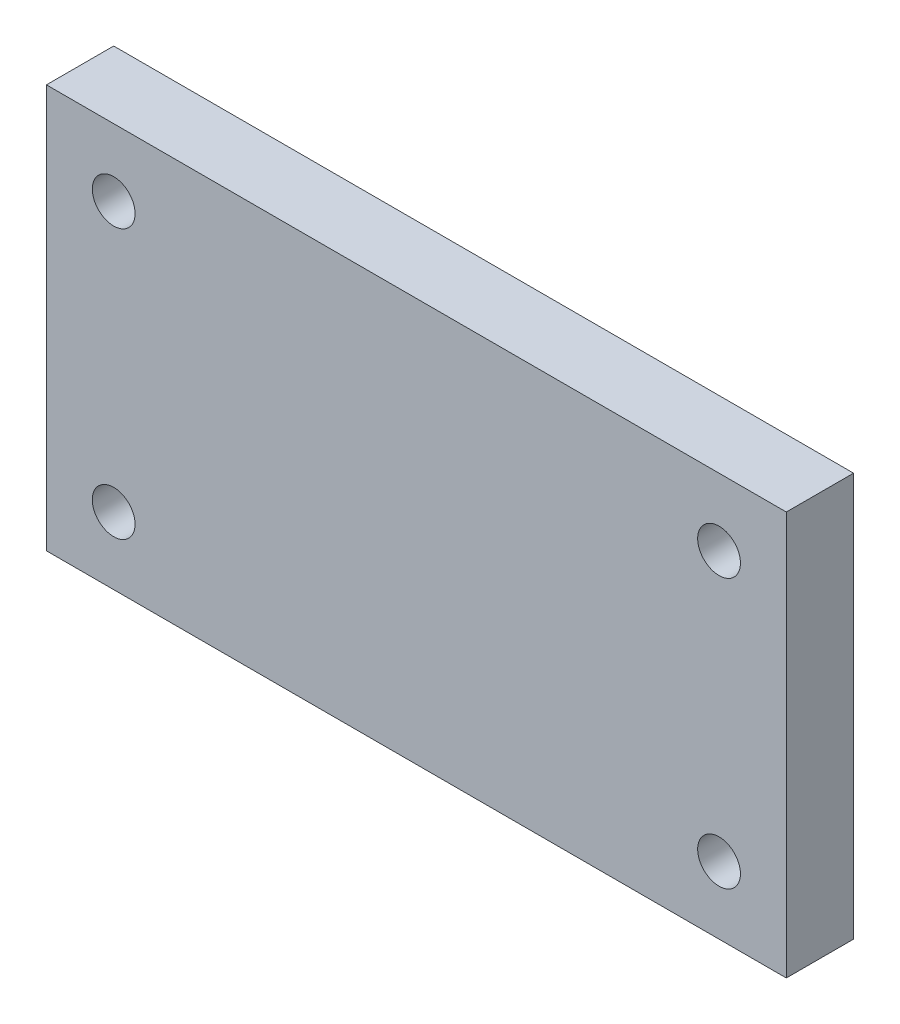
ISO-10303-21;
HEADER;
FILE_DESCRIPTION(('STEP AP214'),'2;1');
FILE_NAME('part.step','',(''),(''),'','','');
FILE_SCHEMA(('AUTOMOTIVE_DESIGN { 1 0 10303 214 1 1 1 1 }'));
ENDSEC;
DATA;
#1=APPLICATION_CONTEXT('core data for automotive mechanical design processes');
#2=APPLICATION_PROTOCOL_DEFINITION('international standard','automotive_design',2000,#1);
#3=PRODUCT_CONTEXT('',#1,'mechanical');
#4=PRODUCT('Part','Part','',(#3));
#5=PRODUCT_RELATED_PRODUCT_CATEGORY('part','',(#4));
#6=PRODUCT_DEFINITION_FORMATION('','',#4);
#7=PRODUCT_DEFINITION_CONTEXT('part definition',#1,'design');
#8=PRODUCT_DEFINITION('design','',#6,#7);
#9=PRODUCT_DEFINITION_SHAPE('','',#8);
#10=(LENGTH_UNIT() NAMED_UNIT(*) SI_UNIT(.MILLI.,.METRE.));
#11=(NAMED_UNIT(*) PLANE_ANGLE_UNIT() SI_UNIT($,.RADIAN.));
#12=(NAMED_UNIT(*) SI_UNIT($,.STERADIAN.) SOLID_ANGLE_UNIT());
#13=UNCERTAINTY_MEASURE_WITH_UNIT(LENGTH_MEASURE(1.E-05),#10,'distance_accuracy_value','');
#14=(GEOMETRIC_REPRESENTATION_CONTEXT(3) GLOBAL_UNCERTAINTY_ASSIGNED_CONTEXT((#13)) GLOBAL_UNIT_ASSIGNED_CONTEXT((#10,
#11,#12)) REPRESENTATION_CONTEXT('',''));
#15=CARTESIAN_POINT('',(0.,0.,0.));
#16=DIRECTION('',(0.,0.,1.));
#17=DIRECTION('',(1.,0.,0.));
#18=AXIS2_PLACEMENT_3D('',#15,#16,#17);
#19=CARTESIAN_POINT('',(23.0502000000002,0.,6.35));
#20=DIRECTION('',(-1.,0.,0.));
#21=DIRECTION('',(0.,0.,1.));
#22=AXIS2_PLACEMENT_3D('',#19,#20,#21);
#23=PLANE('',#22);
#24=DIRECTION('',(0.,1.,0.));
#25=VECTOR('',#24,1.);
#26=CARTESIAN_POINT('',(23.0502000000002,0.,0.));
#27=LINE('',#26,#25);
#28=CARTESIAN_POINT('',(23.0502000000002,-19.05,0.));
#29=VERTEX_POINT('',#28);
#30=CARTESIAN_POINT('',(23.0502000000002,19.05,0.));
#31=VERTEX_POINT('',#30);
#32=EDGE_CURVE('E116',#29,#31,#27,.T.);
#33=ORIENTED_EDGE('',*,*,#32,.F.);
#34=DIRECTION('',(0.,0.,-1.));
#35=VECTOR('',#34,1.);
#36=CARTESIAN_POINT('',(23.0502000000002,-19.05,6.35));
#37=LINE('',#36,#35);
#38=CARTESIAN_POINT('',(23.0502000000002,-19.05,6.35));
#39=VERTEX_POINT('',#38);
#40=EDGE_CURVE('E11',#39,#29,#37,.T.);
#41=ORIENTED_EDGE('',*,*,#40,.F.);
#42=DIRECTION('',(0.,1.,0.));
#43=VECTOR('',#42,1.);
#44=CARTESIAN_POINT('',(23.0502000000002,0.,6.35));
#45=LINE('',#44,#43);
#46=CARTESIAN_POINT('',(23.0502000000002,19.05,6.35));
#47=VERTEX_POINT('',#46);
#48=EDGE_CURVE('E97',#39,#47,#45,.T.);
#49=ORIENTED_EDGE('',*,*,#48,.T.);
#50=DIRECTION('',(0.,0.,-1.));
#51=VECTOR('',#50,1.);
#52=CARTESIAN_POINT('',(23.0502000000002,19.05,6.35));
#53=LINE('',#52,#51);
#54=EDGE_CURVE('E76',#47,#31,#53,.T.);
#55=ORIENTED_EDGE('',*,*,#54,.T.);
#56=EDGE_LOOP('',(#33,#41,#49,#55));
#57=FACE_BOUND('',#56,.T.);
#58=ADVANCED_FACE('F36',(#57),#23,.T.);
#59=CARTESIAN_POINT('',(0.,-19.05,6.35));
#60=DIRECTION('',(0.,-1.,0.));
#61=DIRECTION('',(0.,0.,-1.));
#62=AXIS2_PLACEMENT_3D('',#59,#60,#61);
#63=PLANE('',#62);
#64=DIRECTION('',(-1.,0.,0.));
#65=VECTOR('',#64,1.);
#66=CARTESIAN_POINT('',(0.,-19.05,0.));
#67=LINE('',#66,#65);
#68=CARTESIAN_POINT('',(92.9002000000002,-19.05,0.));
#69=VERTEX_POINT('',#68);
#70=EDGE_CURVE('E88',#69,#29,#67,.T.);
#71=ORIENTED_EDGE('',*,*,#70,.F.);
#72=DIRECTION('',(0.,0.,-1.));
#73=VECTOR('',#72,1.);
#74=CARTESIAN_POINT('',(92.9002000000002,-19.05,6.35));
#75=LINE('',#74,#73);
#76=CARTESIAN_POINT('',(92.9002000000002,-19.05,6.35));
#77=VERTEX_POINT('',#76);
#78=EDGE_CURVE('E45',#77,#69,#75,.T.);
#79=ORIENTED_EDGE('',*,*,#78,.F.);
#80=DIRECTION('',(-1.,0.,0.));
#81=VECTOR('',#80,1.);
#82=CARTESIAN_POINT('',(0.,-19.05,6.35));
#83=LINE('',#82,#81);
#84=EDGE_CURVE('E86',#77,#39,#83,.T.);
#85=ORIENTED_EDGE('',*,*,#84,.T.);
#86=ORIENTED_EDGE('',*,*,#40,.T.);
#87=EDGE_LOOP('',(#71,#79,#85,#86));
#88=FACE_BOUND('',#87,.T.);
#89=ADVANCED_FACE('F84',(#88),#63,.T.);
#90=CARTESIAN_POINT('',(92.9002000000002,0.,6.35));
#91=DIRECTION('',(-1.,0.,0.));
#92=DIRECTION('',(0.,-1.,0.));
#93=AXIS2_PLACEMENT_3D('',#90,#91,#92);
#94=PLANE('',#93);
#95=DIRECTION('',(0.,1.,0.));
#96=VECTOR('',#95,1.);
#97=CARTESIAN_POINT('',(92.9002000000002,0.,0.));
#98=LINE('',#97,#96);
#99=CARTESIAN_POINT('',(92.9002000000002,19.05,0.));
#100=VERTEX_POINT('',#99);
#101=EDGE_CURVE('E119',#69,#100,#98,.T.);
#102=ORIENTED_EDGE('',*,*,#101,.T.);
#103=DIRECTION('',(0.,0.,-1.));
#104=VECTOR('',#103,1.);
#105=CARTESIAN_POINT('',(92.9002000000002,19.05,6.35));
#106=LINE('',#105,#104);
#107=CARTESIAN_POINT('',(92.9002000000002,19.05,6.35));
#108=VERTEX_POINT('',#107);
#109=EDGE_CURVE('E91',#108,#100,#106,.T.);
#110=ORIENTED_EDGE('',*,*,#109,.F.);
#111=DIRECTION('',(0.,1.,0.));
#112=VECTOR('',#111,1.);
#113=CARTESIAN_POINT('',(92.9002000000002,0.,6.35));
#114=LINE('',#113,#112);
#115=EDGE_CURVE('E93',#77,#108,#114,.T.);
#116=ORIENTED_EDGE('',*,*,#115,.F.);
#117=ORIENTED_EDGE('',*,*,#78,.T.);
#118=EDGE_LOOP('',(#102,#110,#116,#117));
#119=FACE_BOUND('',#118,.T.);
#120=ADVANCED_FACE('F94',(#119),#94,.F.);
#121=CARTESIAN_POINT('',(86.5502000000002,12.7,6.35));
#122=DIRECTION('',(0.,0.,-1.));
#123=DIRECTION('',(-1.,0.,0.));
#124=AXIS2_PLACEMENT_3D('',#121,#122,#123);
#125=CYLINDRICAL_SURFACE('',#124,2.01929999999986);
#126=CARTESIAN_POINT('',(86.5502000000002,12.7,6.35));
#127=DIRECTION('',(0.,0.,1.));
#128=DIRECTION('',(1.,0.,0.));
#129=AXIS2_PLACEMENT_3D('',#126,#127,#128);
#130=CIRCLE('',#129,2.01929999999986);
#131=CARTESIAN_POINT('',(88.5695000000001,12.7,6.35));
#132=VERTEX_POINT('',#131);
#133=EDGE_CURVE('E99',#132,#132,#130,.T.);
#134=ORIENTED_EDGE('',*,*,#133,.T.);
#135=EDGE_LOOP('',(#134));
#136=FACE_BOUND('',#135,.T.);
#137=CARTESIAN_POINT('',(86.5502000000002,12.7,0.));
#138=DIRECTION('',(0.,0.,1.));
#139=DIRECTION('',(1.,0.,0.));
#140=AXIS2_PLACEMENT_3D('',#137,#138,#139);
#141=CIRCLE('',#140,2.01929999999986);
#142=CARTESIAN_POINT('',(88.5695000000001,12.7,0.));
#143=VERTEX_POINT('',#142);
#144=EDGE_CURVE('E113',#143,#143,#141,.T.);
#145=ORIENTED_EDGE('',*,*,#144,.F.);
#146=EDGE_LOOP('',(#145));
#147=FACE_BOUND('',#146,.T.);
#148=ADVANCED_FACE('F135',(#136,#147),#125,.F.);
#149=CARTESIAN_POINT('',(29.4002000000002,12.7,6.35));
#150=DIRECTION('',(0.,0.,-1.));
#151=DIRECTION('',(-1.,0.,0.));
#152=AXIS2_PLACEMENT_3D('',#149,#150,#151);
#153=CYLINDRICAL_SURFACE('',#152,2.01930000000001);
#154=CARTESIAN_POINT('',(29.4002000000002,12.7,6.35));
#155=DIRECTION('',(0.,0.,1.));
#156=DIRECTION('',(1.,0.,0.));
#157=AXIS2_PLACEMENT_3D('',#154,#155,#156);
#158=CIRCLE('',#157,2.01930000000001);
#159=CARTESIAN_POINT('',(31.4195000000003,12.7,6.35));
#160=VERTEX_POINT('',#159);
#161=EDGE_CURVE('E235',#160,#160,#158,.T.);
#162=ORIENTED_EDGE('',*,*,#161,.T.);
#163=EDGE_LOOP('',(#162));
#164=FACE_BOUND('',#163,.T.);
#165=CARTESIAN_POINT('',(29.4002000000002,12.7,0.));
#166=DIRECTION('',(0.,0.,1.));
#167=DIRECTION('',(1.,0.,0.));
#168=AXIS2_PLACEMENT_3D('',#165,#166,#167);
#169=CIRCLE('',#168,2.01930000000001);
#170=CARTESIAN_POINT('',(31.4195000000003,12.7,0.));
#171=VERTEX_POINT('',#170);
#172=EDGE_CURVE('E110',#171,#171,#169,.T.);
#173=ORIENTED_EDGE('',*,*,#172,.F.);
#174=EDGE_LOOP('',(#173));
#175=FACE_BOUND('',#174,.T.);
#176=ADVANCED_FACE('F138',(#164,#175),#153,.F.);
#177=CARTESIAN_POINT('',(29.4002000000003,-12.7,6.35));
#178=DIRECTION('',(0.,0.,-1.));
#179=DIRECTION('',(-1.,0.,0.));
#180=AXIS2_PLACEMENT_3D('',#177,#178,#179);
#181=CYLINDRICAL_SURFACE('',#180,2.01929999999986);
#182=CARTESIAN_POINT('',(29.4002000000003,-12.7,6.35));
#183=DIRECTION('',(0.,0.,1.));
#184=DIRECTION('',(1.,0.,0.));
#185=AXIS2_PLACEMENT_3D('',#182,#183,#184);
#186=CIRCLE('',#185,2.01929999999986);
#187=CARTESIAN_POINT('',(31.4195000000001,-12.7,6.35));
#188=VERTEX_POINT('',#187);
#189=EDGE_CURVE('E152',#188,#188,#186,.T.);
#190=ORIENTED_EDGE('',*,*,#189,.T.);
#191=EDGE_LOOP('',(#190));
#192=FACE_BOUND('',#191,.T.);
#193=CARTESIAN_POINT('',(29.4002000000003,-12.7,0.));
#194=DIRECTION('',(0.,0.,1.));
#195=DIRECTION('',(1.,0.,0.));
#196=AXIS2_PLACEMENT_3D('',#193,#194,#195);
#197=CIRCLE('',#196,2.01929999999986);
#198=CARTESIAN_POINT('',(31.4195000000001,-12.7,0.));
#199=VERTEX_POINT('',#198);
#200=EDGE_CURVE('E107',#199,#199,#197,.T.);
#201=ORIENTED_EDGE('',*,*,#200,.F.);
#202=EDGE_LOOP('',(#201));
#203=FACE_BOUND('',#202,.T.);
#204=ADVANCED_FACE('F141',(#192,#203),#181,.F.);
#205=CARTESIAN_POINT('',(86.5502000000002,-12.7,6.35));
#206=DIRECTION('',(0.,0.,-1.));
#207=DIRECTION('',(-1.,0.,0.));
#208=AXIS2_PLACEMENT_3D('',#205,#206,#207);
#209=CYLINDRICAL_SURFACE('',#208,2.01929999999986);
#210=CARTESIAN_POINT('',(86.5502000000002,-12.7,6.35));
#211=DIRECTION('',(0.,0.,1.));
#212=DIRECTION('',(1.,0.,0.));
#213=AXIS2_PLACEMENT_3D('',#210,#211,#212);
#214=CIRCLE('',#213,2.01929999999986);
#215=CARTESIAN_POINT('',(88.5695000000001,-12.7,6.35));
#216=VERTEX_POINT('',#215);
#217=EDGE_CURVE('E122',#216,#216,#214,.T.);
#218=ORIENTED_EDGE('',*,*,#217,.T.);
#219=EDGE_LOOP('',(#218));
#220=FACE_BOUND('',#219,.T.);
#221=CARTESIAN_POINT('',(86.5502000000002,-12.7,0.));
#222=DIRECTION('',(0.,0.,1.));
#223=DIRECTION('',(1.,0.,0.));
#224=AXIS2_PLACEMENT_3D('',#221,#222,#223);
#225=CIRCLE('',#224,2.01929999999986);
#226=CARTESIAN_POINT('',(88.5695000000001,-12.7,0.));
#227=VERTEX_POINT('',#226);
#228=EDGE_CURVE('E104',#227,#227,#225,.T.);
#229=ORIENTED_EDGE('',*,*,#228,.F.);
#230=EDGE_LOOP('',(#229));
#231=FACE_BOUND('',#230,.T.);
#232=ADVANCED_FACE('F38',(#220,#231),#209,.F.);
#233=CARTESIAN_POINT('',(0.,19.05,6.35));
#234=DIRECTION('',(0.,-1.,0.));
#235=DIRECTION('',(0.,0.,-1.));
#236=AXIS2_PLACEMENT_3D('',#233,#234,#235);
#237=PLANE('',#236);
#238=DIRECTION('',(-1.,0.,0.));
#239=VECTOR('',#238,1.);
#240=CARTESIAN_POINT('',(0.,19.05,0.));
#241=LINE('',#240,#239);
#242=EDGE_CURVE('E69',#100,#31,#241,.T.);
#243=ORIENTED_EDGE('',*,*,#242,.T.);
#244=ORIENTED_EDGE('',*,*,#54,.F.);
#245=DIRECTION('',(-1.,0.,0.));
#246=VECTOR('',#245,1.);
#247=CARTESIAN_POINT('',(0.,19.05,6.35));
#248=LINE('',#247,#246);
#249=EDGE_CURVE('E53',#108,#47,#248,.T.);
#250=ORIENTED_EDGE('',*,*,#249,.F.);
#251=ORIENTED_EDGE('',*,*,#109,.T.);
#252=EDGE_LOOP('',(#243,#244,#250,#251));
#253=FACE_BOUND('',#252,.T.);
#254=ADVANCED_FACE('F125',(#253),#237,.F.);
#255=CARTESIAN_POINT('',(0.,0.,6.35));
#256=DIRECTION('',(0.,0.,1.));
#257=DIRECTION('',(1.,0.,0.));
#258=AXIS2_PLACEMENT_3D('',#255,#256,#257);
#259=PLANE('',#258);
#260=ORIENTED_EDGE('',*,*,#217,.F.);
#261=EDGE_LOOP('',(#260));
#262=FACE_BOUND('',#261,.T.);
#263=ORIENTED_EDGE('',*,*,#189,.F.);
#264=EDGE_LOOP('',(#263));
#265=FACE_BOUND('',#264,.T.);
#266=ORIENTED_EDGE('',*,*,#161,.F.);
#267=EDGE_LOOP('',(#266));
#268=FACE_BOUND('',#267,.T.);
#269=ORIENTED_EDGE('',*,*,#133,.F.);
#270=EDGE_LOOP('',(#269));
#271=FACE_BOUND('',#270,.T.);
#272=ORIENTED_EDGE('',*,*,#48,.F.);
#273=ORIENTED_EDGE('',*,*,#84,.F.);
#274=ORIENTED_EDGE('',*,*,#115,.T.);
#275=ORIENTED_EDGE('',*,*,#249,.T.);
#276=EDGE_LOOP('',(#272,#273,#274,#275));
#277=FACE_BOUND('',#276,.T.);
#278=ADVANCED_FACE('F96',(#262,#265,#268,#271,#277),#259,.T.);
#279=CARTESIAN_POINT('',(0.,0.,0.));
#280=DIRECTION('',(0.,0.,1.));
#281=DIRECTION('',(1.,0.,0.));
#282=AXIS2_PLACEMENT_3D('',#279,#280,#281);
#283=PLANE('',#282);
#284=ORIENTED_EDGE('',*,*,#228,.T.);
#285=EDGE_LOOP('',(#284));
#286=FACE_BOUND('',#285,.T.);
#287=ORIENTED_EDGE('',*,*,#200,.T.);
#288=EDGE_LOOP('',(#287));
#289=FACE_BOUND('',#288,.T.);
#290=ORIENTED_EDGE('',*,*,#172,.T.);
#291=EDGE_LOOP('',(#290));
#292=FACE_BOUND('',#291,.T.);
#293=ORIENTED_EDGE('',*,*,#144,.T.);
#294=EDGE_LOOP('',(#293));
#295=FACE_BOUND('',#294,.T.);
#296=ORIENTED_EDGE('',*,*,#32,.T.);
#297=ORIENTED_EDGE('',*,*,#242,.F.);
#298=ORIENTED_EDGE('',*,*,#101,.F.);
#299=ORIENTED_EDGE('',*,*,#70,.T.);
#300=EDGE_LOOP('',(#296,#297,#298,#299));
#301=FACE_BOUND('',#300,.T.);
#302=ADVANCED_FACE('F126',(#286,#289,#292,#295,#301),#283,.F.);
#303=CLOSED_SHELL('',(#58,#89,#120,#148,#176,#204,#232,#254,#278,#302));
#304=MANIFOLD_SOLID_BREP('B2',#303);
#305=ADVANCED_BREP_SHAPE_REPRESENTATION('',(#18,#304),#14);
#306=SHAPE_DEFINITION_REPRESENTATION(#9,#305);
ENDSEC;
END-ISO-10303-21;
